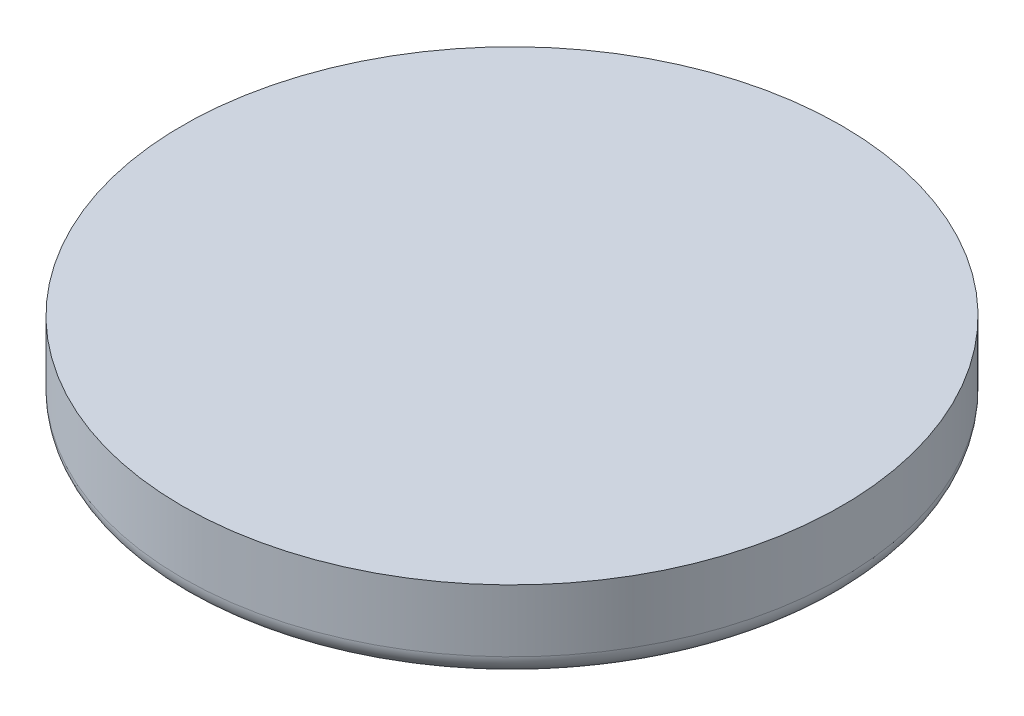
ISO-10303-21;
HEADER;
FILE_DESCRIPTION(('STEP AP214'),'2;1');
FILE_NAME('part.step','',(''),(''),'','','');
FILE_SCHEMA(('AUTOMOTIVE_DESIGN { 1 0 10303 214 1 1 1 1 }'));
ENDSEC;
DATA;
#1=APPLICATION_CONTEXT('core data for automotive mechanical design processes');
#2=APPLICATION_PROTOCOL_DEFINITION('international standard','automotive_design',2000,#1);
#3=PRODUCT_CONTEXT('',#1,'mechanical');
#4=PRODUCT('Part','Part','',(#3));
#5=PRODUCT_RELATED_PRODUCT_CATEGORY('part','',(#4));
#6=PRODUCT_DEFINITION_FORMATION('','',#4);
#7=PRODUCT_DEFINITION_CONTEXT('part definition',#1,'design');
#8=PRODUCT_DEFINITION('design','',#6,#7);
#9=PRODUCT_DEFINITION_SHAPE('','',#8);
#10=(LENGTH_UNIT() NAMED_UNIT(*) SI_UNIT(.MILLI.,.METRE.));
#11=(NAMED_UNIT(*) PLANE_ANGLE_UNIT() SI_UNIT($,.RADIAN.));
#12=(NAMED_UNIT(*) SI_UNIT($,.STERADIAN.) SOLID_ANGLE_UNIT());
#13=UNCERTAINTY_MEASURE_WITH_UNIT(LENGTH_MEASURE(1.E-05),#10,'distance_accuracy_value','');
#14=(GEOMETRIC_REPRESENTATION_CONTEXT(3) GLOBAL_UNCERTAINTY_ASSIGNED_CONTEXT((#13)) GLOBAL_UNIT_ASSIGNED_CONTEXT((#10,
#11,#12)) REPRESENTATION_CONTEXT('',''));
#15=CARTESIAN_POINT('',(0.,0.,0.));
#16=DIRECTION('',(0.,0.,1.));
#17=DIRECTION('',(1.,0.,0.));
#18=AXIS2_PLACEMENT_3D('',#15,#16,#17);
#19=CARTESIAN_POINT('',(0.,0.8,0.));
#20=DIRECTION('',(0.,-1.,0.));
#21=DIRECTION('',(0.,0.,-1.));
#22=AXIS2_PLACEMENT_3D('',#19,#20,#21);
#23=CYLINDRICAL_SURFACE('',#22,3.175);
#24=CARTESIAN_POINT('',(0.,0.2,0.));
#25=DIRECTION('',(0.,1.,0.));
#26=DIRECTION('',(0.,0.,1.));
#27=AXIS2_PLACEMENT_3D('',#24,#25,#26);
#28=CIRCLE('',#27,3.175);
#29=CARTESIAN_POINT('',(0.,0.2,3.175));
#30=VERTEX_POINT('',#29);
#31=EDGE_CURVE('E49',#30,#30,#28,.T.);
#32=ORIENTED_EDGE('',*,*,#31,.T.);
#33=EDGE_LOOP('',(#32));
#34=FACE_BOUND('',#33,.T.);
#35=CARTESIAN_POINT('',(0.,0.8,0.));
#36=DIRECTION('',(0.,1.,0.));
#37=DIRECTION('',(0.,0.,1.));
#38=AXIS2_PLACEMENT_3D('',#35,#36,#37);
#39=CIRCLE('',#38,3.175);
#40=CARTESIAN_POINT('',(0.,0.8,3.175));
#41=VERTEX_POINT('',#40);
#42=EDGE_CURVE('E54',#41,#41,#39,.T.);
#43=ORIENTED_EDGE('',*,*,#42,.F.);
#44=EDGE_LOOP('',(#43));
#45=FACE_BOUND('',#44,.T.);
#46=ADVANCED_FACE('F41',(#34,#45),#23,.T.);
#47=CARTESIAN_POINT('',(0.,0.8,0.));
#48=DIRECTION('',(0.,1.,0.));
#49=DIRECTION('',(0.,0.,1.));
#50=AXIS2_PLACEMENT_3D('',#47,#48,#49);
#51=PLANE('',#50);
#52=ORIENTED_EDGE('',*,*,#42,.T.);
#53=EDGE_LOOP('',(#52));
#54=FACE_BOUND('',#53,.T.);
#55=ADVANCED_FACE('F62',(#54),#51,.T.);
#56=CARTESIAN_POINT('',(0.,0.,0.));
#57=DIRECTION('',(0.,1.,0.));
#58=DIRECTION('',(0.,0.,1.));
#59=AXIS2_PLACEMENT_3D('',#56,#57,#58);
#60=PLANE('',#59);
#61=CARTESIAN_POINT('',(0.,0.,0.));
#62=DIRECTION('',(0.,1.,0.));
#63=DIRECTION('',(0.,0.,1.));
#64=AXIS2_PLACEMENT_3D('',#61,#62,#63);
#65=CIRCLE('',#64,2.975);
#66=CARTESIAN_POINT('',(0.,0.,2.975));
#67=VERTEX_POINT('',#66);
#68=EDGE_CURVE('E10',#67,#67,#65,.F.);
#69=ORIENTED_EDGE('',*,*,#68,.T.);
#70=EDGE_LOOP('',(#69));
#71=FACE_BOUND('',#70,.T.);
#72=ADVANCED_FACE('F68',(#71),#60,.F.);
#73=CARTESIAN_POINT('',(0.,0.2,0.));
#74=DIRECTION('',(0.,1.,0.));
#75=DIRECTION('',(0.,0.,1.));
#76=AXIS2_PLACEMENT_3D('',#73,#74,#75);
#77=TOROIDAL_SURFACE('',#76,2.975,0.2);
#78=ORIENTED_EDGE('',*,*,#68,.F.);
#79=EDGE_LOOP('',(#78));
#80=FACE_BOUND('',#79,.T.);
#81=ORIENTED_EDGE('',*,*,#31,.F.);
#82=EDGE_LOOP('',(#81));
#83=FACE_BOUND('',#82,.T.);
#84=ADVANCED_FACE('F43',(#80,#83),#77,.T.);
#85=CLOSED_SHELL('',(#46,#55,#72,#84));
#86=MANIFOLD_SOLID_BREP('B2',#85);
#87=ADVANCED_BREP_SHAPE_REPRESENTATION('',(#18,#86),#14);
#88=SHAPE_DEFINITION_REPRESENTATION(#9,#87);
ENDSEC;
END-ISO-10303-21;
